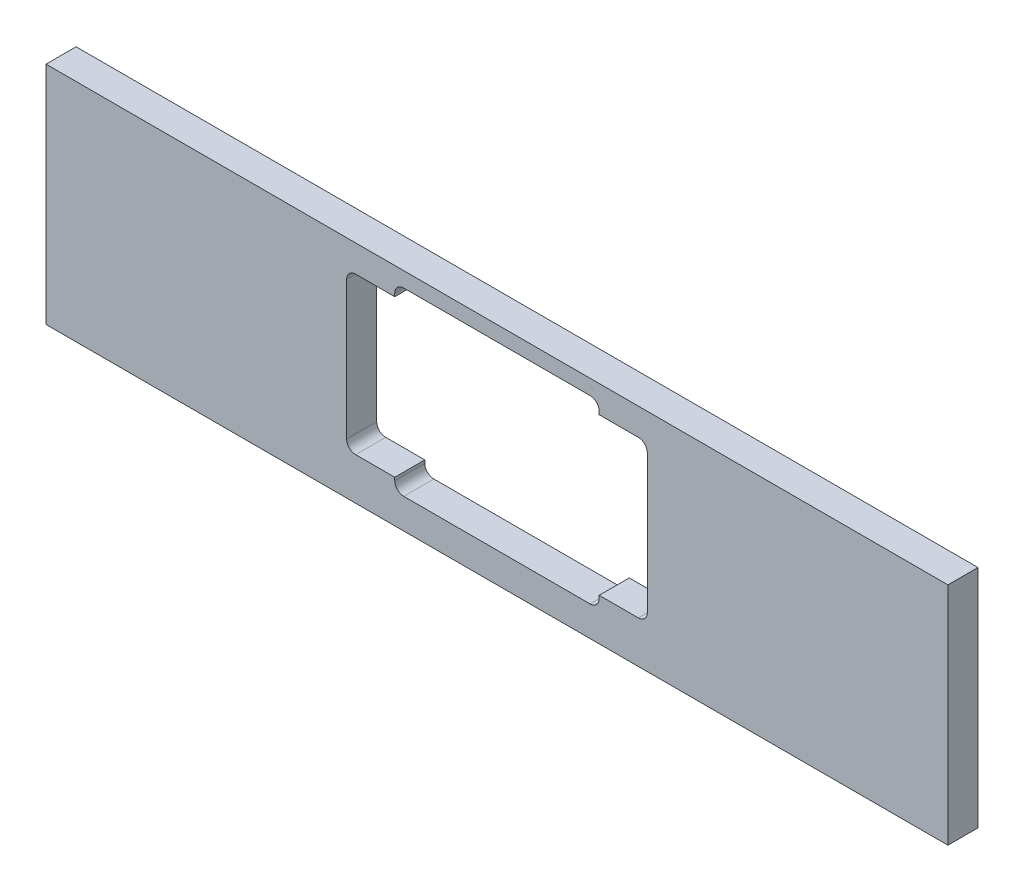
ISO-10303-21;
HEADER;
FILE_DESCRIPTION(('STEP AP214'),'2;1');
FILE_NAME('part.step','',(''),(''),'','','');
FILE_SCHEMA(('AUTOMOTIVE_DESIGN { 1 0 10303 214 1 1 1 1 }'));
ENDSEC;
DATA;
#1=APPLICATION_CONTEXT('core data for automotive mechanical design processes');
#2=APPLICATION_PROTOCOL_DEFINITION('international standard','automotive_design',2000,#1);
#3=PRODUCT_CONTEXT('',#1,'mechanical');
#4=PRODUCT('Part','Part','',(#3));
#5=PRODUCT_RELATED_PRODUCT_CATEGORY('part','',(#4));
#6=PRODUCT_DEFINITION_FORMATION('','',#4);
#7=PRODUCT_DEFINITION_CONTEXT('part definition',#1,'design');
#8=PRODUCT_DEFINITION('design','',#6,#7);
#9=PRODUCT_DEFINITION_SHAPE('','',#8);
#10=(LENGTH_UNIT() NAMED_UNIT(*) SI_UNIT(.MILLI.,.METRE.));
#11=(NAMED_UNIT(*) PLANE_ANGLE_UNIT() SI_UNIT($,.RADIAN.));
#12=(NAMED_UNIT(*) SI_UNIT($,.STERADIAN.) SOLID_ANGLE_UNIT());
#13=UNCERTAINTY_MEASURE_WITH_UNIT(LENGTH_MEASURE(1.E-05),#10,'distance_accuracy_value','');
#14=(GEOMETRIC_REPRESENTATION_CONTEXT(3) GLOBAL_UNCERTAINTY_ASSIGNED_CONTEXT((#13)) GLOBAL_UNIT_ASSIGNED_CONTEXT((#10,
#11,#12)) REPRESENTATION_CONTEXT('',''));
#15=CARTESIAN_POINT('',(0.,0.,0.));
#16=DIRECTION('',(0.,0.,1.));
#17=DIRECTION('',(1.,0.,0.));
#18=AXIS2_PLACEMENT_3D('',#15,#16,#17);
#19=CARTESIAN_POINT('',(150.,-150.,10.));
#20=DIRECTION('',(-1.,0.,0.));
#21=DIRECTION('',(0.,0.,1.));
#22=AXIS2_PLACEMENT_3D('',#19,#20,#21);
#23=PLANE('',#22);
#24=DIRECTION('',(0.,1.,0.));
#25=VECTOR('',#24,1.);
#26=CARTESIAN_POINT('',(150.,-150.,0.));
#27=LINE('',#26,#25);
#28=CARTESIAN_POINT('',(150.,-150.,0.));
#29=VERTEX_POINT('',#28);
#30=CARTESIAN_POINT('',(150.,-75.,0.));
#31=VERTEX_POINT('',#30);
#32=EDGE_CURVE('E275',#29,#31,#27,.T.);
#33=ORIENTED_EDGE('',*,*,#32,.T.);
#34=DIRECTION('',(0.,0.,-1.));
#35=VECTOR('',#34,1.);
#36=CARTESIAN_POINT('',(150.,-75.,10.));
#37=LINE('',#36,#35);
#38=CARTESIAN_POINT('',(150.,-75.,10.));
#39=VERTEX_POINT('',#38);
#40=EDGE_CURVE('E307',#39,#31,#37,.T.);
#41=ORIENTED_EDGE('',*,*,#40,.F.);
#42=DIRECTION('',(0.,1.,0.));
#43=VECTOR('',#42,1.);
#44=CARTESIAN_POINT('',(150.,-150.,10.));
#45=LINE('',#44,#43);
#46=CARTESIAN_POINT('',(150.,-150.,10.));
#47=VERTEX_POINT('',#46);
#48=EDGE_CURVE('E281',#47,#39,#45,.T.);
#49=ORIENTED_EDGE('',*,*,#48,.F.);
#50=DIRECTION('',(0.,0.,-1.));
#51=VECTOR('',#50,1.);
#52=CARTESIAN_POINT('',(150.,-150.,10.));
#53=LINE('',#52,#51);
#54=EDGE_CURVE('E291',#47,#29,#53,.T.);
#55=ORIENTED_EDGE('',*,*,#54,.T.);
#56=EDGE_LOOP('',(#33,#41,#49,#55));
#57=FACE_BOUND('',#56,.T.);
#58=ADVANCED_FACE('F31',(#57),#23,.F.);
#59=CARTESIAN_POINT('',(150.,-75.,10.));
#60=DIRECTION('',(0.,-1.,0.));
#61=DIRECTION('',(1.,0.,0.));
#62=AXIS2_PLACEMENT_3D('',#59,#60,#61);
#63=PLANE('',#62);
#64=DIRECTION('',(-1.,0.,0.));
#65=VECTOR('',#64,1.);
#66=CARTESIAN_POINT('',(150.,-75.,0.));
#67=LINE('',#66,#65);
#68=CARTESIAN_POINT('',(-150.,-75.,0.));
#69=VERTEX_POINT('',#68);
#70=EDGE_CURVE('E294',#31,#69,#67,.T.);
#71=ORIENTED_EDGE('',*,*,#70,.T.);
#72=DIRECTION('',(0.,0.,-1.));
#73=VECTOR('',#72,1.);
#74=CARTESIAN_POINT('',(-150.,-75.,10.));
#75=LINE('',#74,#73);
#76=CARTESIAN_POINT('',(-150.,-75.,10.));
#77=VERTEX_POINT('',#76);
#78=EDGE_CURVE('E304',#77,#69,#75,.T.);
#79=ORIENTED_EDGE('',*,*,#78,.F.);
#80=DIRECTION('',(-1.,0.,0.));
#81=VECTOR('',#80,1.);
#82=CARTESIAN_POINT('',(150.,-75.,10.));
#83=LINE('',#82,#81);
#84=EDGE_CURVE('E284',#39,#77,#83,.T.);
#85=ORIENTED_EDGE('',*,*,#84,.F.);
#86=ORIENTED_EDGE('',*,*,#40,.T.);
#87=EDGE_LOOP('',(#71,#79,#85,#86));
#88=FACE_BOUND('',#87,.T.);
#89=ADVANCED_FACE('F438',(#88),#63,.F.);
#90=CARTESIAN_POINT('',(-150.,-150.,10.));
#91=DIRECTION('',(1.,0.,0.));
#92=DIRECTION('',(0.,0.,-1.));
#93=AXIS2_PLACEMENT_3D('',#90,#91,#92);
#94=PLANE('',#93);
#95=DIRECTION('',(0.,-1.,0.));
#96=VECTOR('',#95,1.);
#97=CARTESIAN_POINT('',(-150.,-150.,0.));
#98=LINE('',#97,#96);
#99=CARTESIAN_POINT('',(-150.,-150.,0.));
#100=VERTEX_POINT('',#99);
#101=EDGE_CURVE('E296',#69,#100,#98,.T.);
#102=ORIENTED_EDGE('',*,*,#101,.T.);
#103=DIRECTION('',(0.,0.,-1.));
#104=VECTOR('',#103,1.);
#105=CARTESIAN_POINT('',(-150.,-150.,10.));
#106=LINE('',#105,#104);
#107=CARTESIAN_POINT('',(-150.,-150.,10.));
#108=VERTEX_POINT('',#107);
#109=EDGE_CURVE('E301',#108,#100,#106,.T.);
#110=ORIENTED_EDGE('',*,*,#109,.F.);
#111=DIRECTION('',(0.,-1.,0.));
#112=VECTOR('',#111,1.);
#113=CARTESIAN_POINT('',(-150.,-150.,10.));
#114=LINE('',#113,#112);
#115=EDGE_CURVE('E287',#77,#108,#114,.T.);
#116=ORIENTED_EDGE('',*,*,#115,.F.);
#117=ORIENTED_EDGE('',*,*,#78,.T.);
#118=EDGE_LOOP('',(#102,#110,#116,#117));
#119=FACE_BOUND('',#118,.T.);
#120=ADVANCED_FACE('F444',(#119),#94,.F.);
#121=CARTESIAN_POINT('',(150.,-150.,10.));
#122=DIRECTION('',(0.,1.,0.));
#123=DIRECTION('',(-1.,0.,0.));
#124=AXIS2_PLACEMENT_3D('',#121,#122,#123);
#125=PLANE('',#124);
#126=DIRECTION('',(1.,0.,0.));
#127=VECTOR('',#126,1.);
#128=CARTESIAN_POINT('',(150.,-150.,0.));
#129=LINE('',#128,#127);
#130=EDGE_CURVE('E285',#100,#29,#129,.T.);
#131=ORIENTED_EDGE('',*,*,#130,.T.);
#132=ORIENTED_EDGE('',*,*,#54,.F.);
#133=DIRECTION('',(1.,0.,0.));
#134=VECTOR('',#133,1.);
#135=CARTESIAN_POINT('',(150.,-150.,10.));
#136=LINE('',#135,#134);
#137=EDGE_CURVE('E289',#108,#47,#136,.T.);
#138=ORIENTED_EDGE('',*,*,#137,.F.);
#139=ORIENTED_EDGE('',*,*,#109,.T.);
#140=EDGE_LOOP('',(#131,#132,#138,#139));
#141=FACE_BOUND('',#140,.T.);
#142=ADVANCED_FACE('F535',(#141),#125,.F.);
#143=CARTESIAN_POINT('',(150.,-75.,10.));
#144=DIRECTION('',(0.,0.,1.));
#145=DIRECTION('',(1.,0.,0.));
#146=AXIS2_PLACEMENT_3D('',#143,#144,#145);
#147=PLANE('',#146);
#148=DIRECTION('',(0.,-1.,0.));
#149=VECTOR('',#148,1.);
#150=CARTESIAN_POINT('',(-34.,-140.,10.));
#151=LINE('',#150,#149);
#152=CARTESIAN_POINT('',(-34.,-136.,10.));
#153=VERTEX_POINT('',#152);
#154=CARTESIAN_POINT('',(-34.,-137.,10.));
#155=VERTEX_POINT('',#154);
#156=EDGE_CURVE('E241',#153,#155,#151,.T.);
#157=ORIENTED_EDGE('',*,*,#156,.F.);
#158=DIRECTION('',(1.,0.,0.));
#159=VECTOR('',#158,1.);
#160=CARTESIAN_POINT('',(-50.,-136.,10.));
#161=LINE('',#160,#159);
#162=CARTESIAN_POINT('',(-46.9999999999999,-136.,10.));
#163=VERTEX_POINT('',#162);
#164=EDGE_CURVE('E269',#163,#153,#161,.T.);
#165=ORIENTED_EDGE('',*,*,#164,.F.);
#166=CARTESIAN_POINT('',(-46.9999999999999,-133.,10.));
#167=DIRECTION('',(0.,0.,1.));
#168=DIRECTION('',(1.,0.,0.));
#169=AXIS2_PLACEMENT_3D('',#166,#167,#168);
#170=CIRCLE('',#169,3.);
#171=CARTESIAN_POINT('',(-50.,-133.,10.));
#172=VERTEX_POINT('',#171);
#173=EDGE_CURVE('E347',#163,#172,#170,.F.);
#174=ORIENTED_EDGE('',*,*,#173,.T.);
#175=DIRECTION('',(0.,-1.,0.));
#176=VECTOR('',#175,1.);
#177=CARTESIAN_POINT('',(-50.,-136.,10.));
#178=LINE('',#177,#176);
#179=CARTESIAN_POINT('',(-50.,-87.,10.));
#180=VERTEX_POINT('',#179);
#181=EDGE_CURVE('E266',#180,#172,#178,.T.);
#182=ORIENTED_EDGE('',*,*,#181,.F.);
#183=CARTESIAN_POINT('',(-46.9999999999999,-87.,10.));
#184=DIRECTION('',(0.,0.,1.));
#185=DIRECTION('',(1.,0.,0.));
#186=AXIS2_PLACEMENT_3D('',#183,#184,#185);
#187=CIRCLE('',#186,3.);
#188=CARTESIAN_POINT('',(-46.9999999999999,-84.,10.));
#189=VERTEX_POINT('',#188);
#190=EDGE_CURVE('E370',#180,#189,#187,.F.);
#191=ORIENTED_EDGE('',*,*,#190,.T.);
#192=DIRECTION('',(-1.,0.,0.));
#193=VECTOR('',#192,1.);
#194=CARTESIAN_POINT('',(-50.,-84.,10.));
#195=LINE('',#194,#193);
#196=CARTESIAN_POINT('',(-34.,-84.,10.));
#197=VERTEX_POINT('',#196);
#198=EDGE_CURVE('E263',#197,#189,#195,.T.);
#199=ORIENTED_EDGE('',*,*,#198,.F.);
#200=DIRECTION('',(0.,-1.,0.));
#201=VECTOR('',#200,1.);
#202=CARTESIAN_POINT('',(-34.,-84.,10.));
#203=LINE('',#202,#201);
#204=CARTESIAN_POINT('',(-34.,-83.,10.));
#205=VERTEX_POINT('',#204);
#206=EDGE_CURVE('E261',#205,#197,#203,.T.);
#207=ORIENTED_EDGE('',*,*,#206,.F.);
#208=CARTESIAN_POINT('',(-31.,-83.,10.));
#209=DIRECTION('',(0.,0.,1.));
#210=DIRECTION('',(1.,0.,0.));
#211=AXIS2_PLACEMENT_3D('',#208,#209,#210);
#212=CIRCLE('',#211,3.);
#213=CARTESIAN_POINT('',(-31.,-80.,10.));
#214=VERTEX_POINT('',#213);
#215=EDGE_CURVE('E39',#205,#214,#212,.F.);
#216=ORIENTED_EDGE('',*,*,#215,.T.);
#217=DIRECTION('',(-1.,0.,0.));
#218=VECTOR('',#217,1.);
#219=CARTESIAN_POINT('',(-34.,-80.,10.));
#220=LINE('',#219,#218);
#221=CARTESIAN_POINT('',(31.,-80.,10.));
#222=VERTEX_POINT('',#221);
#223=EDGE_CURVE('E258',#222,#214,#220,.T.);
#224=ORIENTED_EDGE('',*,*,#223,.F.);
#225=CARTESIAN_POINT('',(31.,-83.,10.));
#226=DIRECTION('',(0.,0.,1.));
#227=DIRECTION('',(1.,0.,0.));
#228=AXIS2_PLACEMENT_3D('',#225,#226,#227);
#229=CIRCLE('',#228,3.);
#230=CARTESIAN_POINT('',(34.,-83.,10.));
#231=VERTEX_POINT('',#230);
#232=EDGE_CURVE('E366',#222,#231,#229,.F.);
#233=ORIENTED_EDGE('',*,*,#232,.T.);
#234=DIRECTION('',(0.,1.,0.));
#235=VECTOR('',#234,1.);
#236=CARTESIAN_POINT('',(34.,-80.,10.));
#237=LINE('',#236,#235);
#238=CARTESIAN_POINT('',(34.,-84.,10.));
#239=VERTEX_POINT('',#238);
#240=EDGE_CURVE('E255',#239,#231,#237,.T.);
#241=ORIENTED_EDGE('',*,*,#240,.F.);
#242=DIRECTION('',(-1.,0.,0.));
#243=VECTOR('',#242,1.);
#244=CARTESIAN_POINT('',(50.,-84.,10.));
#245=LINE('',#244,#243);
#246=CARTESIAN_POINT('',(47.,-84.,10.));
#247=VERTEX_POINT('',#246);
#248=EDGE_CURVE('E253',#247,#239,#245,.T.);
#249=ORIENTED_EDGE('',*,*,#248,.F.);
#250=CARTESIAN_POINT('',(47.,-87.,10.));
#251=DIRECTION('',(0.,0.,1.));
#252=DIRECTION('',(1.,0.,0.));
#253=AXIS2_PLACEMENT_3D('',#250,#251,#252);
#254=CIRCLE('',#253,3.);
#255=CARTESIAN_POINT('',(50.,-87.,10.));
#256=VERTEX_POINT('',#255);
#257=EDGE_CURVE('E362',#247,#256,#254,.F.);
#258=ORIENTED_EDGE('',*,*,#257,.T.);
#259=DIRECTION('',(0.,1.,0.));
#260=VECTOR('',#259,1.);
#261=CARTESIAN_POINT('',(50.,-84.,10.));
#262=LINE('',#261,#260);
#263=CARTESIAN_POINT('',(50.,-133.,10.));
#264=VERTEX_POINT('',#263);
#265=EDGE_CURVE('E250',#264,#256,#262,.T.);
#266=ORIENTED_EDGE('',*,*,#265,.F.);
#267=CARTESIAN_POINT('',(47.,-133.,10.));
#268=DIRECTION('',(0.,0.,1.));
#269=DIRECTION('',(1.,0.,0.));
#270=AXIS2_PLACEMENT_3D('',#267,#268,#269);
#271=CIRCLE('',#270,3.);
#272=CARTESIAN_POINT('',(47.,-136.,10.));
#273=VERTEX_POINT('',#272);
#274=EDGE_CURVE('E355',#264,#273,#271,.F.);
#275=ORIENTED_EDGE('',*,*,#274,.T.);
#276=DIRECTION('',(1.,0.,0.));
#277=VECTOR('',#276,1.);
#278=CARTESIAN_POINT('',(50.,-136.,10.));
#279=LINE('',#278,#277);
#280=CARTESIAN_POINT('',(34.,-136.,10.));
#281=VERTEX_POINT('',#280);
#282=EDGE_CURVE('E248',#281,#273,#279,.T.);
#283=ORIENTED_EDGE('',*,*,#282,.F.);
#284=DIRECTION('',(0.,1.,0.));
#285=VECTOR('',#284,1.);
#286=CARTESIAN_POINT('',(34.,-140.,10.));
#287=LINE('',#286,#285);
#288=CARTESIAN_POINT('',(34.,-137.,10.));
#289=VERTEX_POINT('',#288);
#290=EDGE_CURVE('E210',#289,#281,#287,.T.);
#291=ORIENTED_EDGE('',*,*,#290,.F.);
#292=CARTESIAN_POINT('',(31.,-137.,10.));
#293=DIRECTION('',(0.,0.,1.));
#294=DIRECTION('',(1.,0.,0.));
#295=AXIS2_PLACEMENT_3D('',#292,#293,#294);
#296=CIRCLE('',#295,3.);
#297=CARTESIAN_POINT('',(31.,-140.,10.));
#298=VERTEX_POINT('',#297);
#299=EDGE_CURVE('E359',#289,#298,#296,.F.);
#300=ORIENTED_EDGE('',*,*,#299,.T.);
#301=DIRECTION('',(1.,0.,0.));
#302=VECTOR('',#301,1.);
#303=CARTESIAN_POINT('',(-34.,-140.,10.));
#304=LINE('',#303,#302);
#305=CARTESIAN_POINT('',(-31.,-140.,10.));
#306=VERTEX_POINT('',#305);
#307=EDGE_CURVE('E244',#306,#298,#304,.T.);
#308=ORIENTED_EDGE('',*,*,#307,.F.);
#309=CARTESIAN_POINT('',(-31.,-137.,10.));
#310=DIRECTION('',(0.,0.,1.));
#311=DIRECTION('',(1.,0.,0.));
#312=AXIS2_PLACEMENT_3D('',#309,#310,#311);
#313=CIRCLE('',#312,3.);
#314=EDGE_CURVE('E351',#306,#155,#313,.F.);
#315=ORIENTED_EDGE('',*,*,#314,.T.);
#316=EDGE_LOOP('',(#157,#165,#174,#182,#191,#199,#207,#216,#224,#233,#241,#249,#258,#266,#275,
#283,#291,#300,#308,#315));
#317=FACE_BOUND('',#316,.T.);
#318=ORIENTED_EDGE('',*,*,#48,.T.);
#319=ORIENTED_EDGE('',*,*,#84,.T.);
#320=ORIENTED_EDGE('',*,*,#115,.T.);
#321=ORIENTED_EDGE('',*,*,#137,.T.);
#322=EDGE_LOOP('',(#318,#319,#320,#321));
#323=FACE_BOUND('',#322,.T.);
#324=ADVANCED_FACE('F377',(#317,#323),#147,.T.);
#325=CARTESIAN_POINT('',(150.,-75.,0.));
#326=DIRECTION('',(0.,0.,1.));
#327=DIRECTION('',(1.,0.,0.));
#328=AXIS2_PLACEMENT_3D('',#325,#326,#327);
#329=PLANE('',#328);
#330=DIRECTION('',(0.,-1.,0.));
#331=VECTOR('',#330,1.);
#332=CARTESIAN_POINT('',(-50.,-136.,0.));
#333=LINE('',#332,#331);
#334=CARTESIAN_POINT('',(-50.,-87.,0.));
#335=VERTEX_POINT('',#334);
#336=CARTESIAN_POINT('',(-50.,-133.,0.));
#337=VERTEX_POINT('',#336);
#338=EDGE_CURVE('E238',#335,#337,#333,.T.);
#339=ORIENTED_EDGE('',*,*,#338,.T.);
#340=CARTESIAN_POINT('',(-46.9999999999999,-133.,0.));
#341=DIRECTION('',(0.,0.,1.));
#342=DIRECTION('',(1.,0.,0.));
#343=AXIS2_PLACEMENT_3D('',#340,#341,#342);
#344=CIRCLE('',#343,3.);
#345=CARTESIAN_POINT('',(-46.9999999999999,-136.,0.));
#346=VERTEX_POINT('',#345);
#347=EDGE_CURVE('E349',#337,#346,#344,.T.);
#348=ORIENTED_EDGE('',*,*,#347,.T.);
#349=DIRECTION('',(1.,0.,0.));
#350=VECTOR('',#349,1.);
#351=CARTESIAN_POINT('',(-50.,-136.,0.));
#352=LINE('',#351,#350);
#353=CARTESIAN_POINT('',(-34.,-136.,0.));
#354=VERTEX_POINT('',#353);
#355=EDGE_CURVE('E215',#346,#354,#352,.T.);
#356=ORIENTED_EDGE('',*,*,#355,.T.);
#357=DIRECTION('',(0.,-1.,0.));
#358=VECTOR('',#357,1.);
#359=CARTESIAN_POINT('',(-34.,-140.,0.));
#360=LINE('',#359,#358);
#361=CARTESIAN_POINT('',(-34.,-137.,0.));
#362=VERTEX_POINT('',#361);
#363=EDGE_CURVE('E271',#354,#362,#360,.T.);
#364=ORIENTED_EDGE('',*,*,#363,.T.);
#365=CARTESIAN_POINT('',(-31.,-137.,0.));
#366=DIRECTION('',(0.,0.,1.));
#367=DIRECTION('',(1.,0.,0.));
#368=AXIS2_PLACEMENT_3D('',#365,#366,#367);
#369=CIRCLE('',#368,3.);
#370=CARTESIAN_POINT('',(-31.,-140.,0.));
#371=VERTEX_POINT('',#370);
#372=EDGE_CURVE('E353',#362,#371,#369,.T.);
#373=ORIENTED_EDGE('',*,*,#372,.T.);
#374=DIRECTION('',(1.,0.,0.));
#375=VECTOR('',#374,1.);
#376=CARTESIAN_POINT('',(-34.,-140.,0.));
#377=LINE('',#376,#375);
#378=CARTESIAN_POINT('',(31.,-140.,0.));
#379=VERTEX_POINT('',#378);
#380=EDGE_CURVE('E204',#371,#379,#377,.T.);
#381=ORIENTED_EDGE('',*,*,#380,.T.);
#382=CARTESIAN_POINT('',(31.,-137.,0.));
#383=DIRECTION('',(0.,0.,1.));
#384=DIRECTION('',(1.,0.,0.));
#385=AXIS2_PLACEMENT_3D('',#382,#383,#384);
#386=CIRCLE('',#385,3.);
#387=CARTESIAN_POINT('',(34.,-137.,0.));
#388=VERTEX_POINT('',#387);
#389=EDGE_CURVE('E200',#379,#388,#386,.T.);
#390=ORIENTED_EDGE('',*,*,#389,.T.);
#391=DIRECTION('',(0.,1.,0.));
#392=VECTOR('',#391,1.);
#393=CARTESIAN_POINT('',(34.,-140.,0.));
#394=LINE('',#393,#392);
#395=CARTESIAN_POINT('',(34.,-136.,0.));
#396=VERTEX_POINT('',#395);
#397=EDGE_CURVE('E190',#388,#396,#394,.T.);
#398=ORIENTED_EDGE('',*,*,#397,.T.);
#399=DIRECTION('',(1.,0.,0.));
#400=VECTOR('',#399,1.);
#401=CARTESIAN_POINT('',(50.,-136.,0.));
#402=LINE('',#401,#400);
#403=CARTESIAN_POINT('',(47.,-136.,0.));
#404=VERTEX_POINT('',#403);
#405=EDGE_CURVE('E196',#396,#404,#402,.T.);
#406=ORIENTED_EDGE('',*,*,#405,.T.);
#407=CARTESIAN_POINT('',(47.,-133.,0.));
#408=DIRECTION('',(0.,0.,1.));
#409=DIRECTION('',(1.,0.,0.));
#410=AXIS2_PLACEMENT_3D('',#407,#408,#409);
#411=CIRCLE('',#410,3.);
#412=CARTESIAN_POINT('',(50.,-133.,0.));
#413=VERTEX_POINT('',#412);
#414=EDGE_CURVE('E357',#404,#413,#411,.T.);
#415=ORIENTED_EDGE('',*,*,#414,.T.);
#416=DIRECTION('',(0.,1.,0.));
#417=VECTOR('',#416,1.);
#418=CARTESIAN_POINT('',(50.,-84.,0.));
#419=LINE('',#418,#417);
#420=CARTESIAN_POINT('',(50.,-87.,0.));
#421=VERTEX_POINT('',#420);
#422=EDGE_CURVE('E220',#413,#421,#419,.T.);
#423=ORIENTED_EDGE('',*,*,#422,.T.);
#424=CARTESIAN_POINT('',(47.,-87.,0.));
#425=DIRECTION('',(0.,0.,1.));
#426=DIRECTION('',(1.,0.,0.));
#427=AXIS2_PLACEMENT_3D('',#424,#425,#426);
#428=CIRCLE('',#427,3.);
#429=CARTESIAN_POINT('',(47.,-84.,0.));
#430=VERTEX_POINT('',#429);
#431=EDGE_CURVE('E364',#421,#430,#428,.T.);
#432=ORIENTED_EDGE('',*,*,#431,.T.);
#433=DIRECTION('',(-1.,0.,0.));
#434=VECTOR('',#433,1.);
#435=CARTESIAN_POINT('',(50.,-84.,0.));
#436=LINE('',#435,#434);
#437=CARTESIAN_POINT('',(34.,-84.,0.));
#438=VERTEX_POINT('',#437);
#439=EDGE_CURVE('E223',#430,#438,#436,.T.);
#440=ORIENTED_EDGE('',*,*,#439,.T.);
#441=DIRECTION('',(0.,1.,0.));
#442=VECTOR('',#441,1.);
#443=CARTESIAN_POINT('',(34.,-80.,0.));
#444=LINE('',#443,#442);
#445=CARTESIAN_POINT('',(34.,-83.,0.));
#446=VERTEX_POINT('',#445);
#447=EDGE_CURVE('E228',#438,#446,#444,.T.);
#448=ORIENTED_EDGE('',*,*,#447,.T.);
#449=CARTESIAN_POINT('',(31.,-83.,0.));
#450=DIRECTION('',(0.,0.,1.));
#451=DIRECTION('',(1.,0.,0.));
#452=AXIS2_PLACEMENT_3D('',#449,#450,#451);
#453=CIRCLE('',#452,3.);
#454=CARTESIAN_POINT('',(31.,-80.,0.));
#455=VERTEX_POINT('',#454);
#456=EDGE_CURVE('E368',#446,#455,#453,.T.);
#457=ORIENTED_EDGE('',*,*,#456,.T.);
#458=DIRECTION('',(-1.,0.,0.));
#459=VECTOR('',#458,1.);
#460=CARTESIAN_POINT('',(-34.,-80.,0.));
#461=LINE('',#460,#459);
#462=CARTESIAN_POINT('',(-31.,-80.,0.));
#463=VERTEX_POINT('',#462);
#464=EDGE_CURVE('E231',#455,#463,#461,.T.);
#465=ORIENTED_EDGE('',*,*,#464,.T.);
#466=CARTESIAN_POINT('',(-31.,-83.,0.));
#467=DIRECTION('',(0.,0.,1.));
#468=DIRECTION('',(1.,0.,0.));
#469=AXIS2_PLACEMENT_3D('',#466,#467,#468);
#470=CIRCLE('',#469,3.);
#471=CARTESIAN_POINT('',(-34.,-83.,0.));
#472=VERTEX_POINT('',#471);
#473=EDGE_CURVE('E11',#463,#472,#470,.T.);
#474=ORIENTED_EDGE('',*,*,#473,.T.);
#475=DIRECTION('',(0.,-1.,0.));
#476=VECTOR('',#475,1.);
#477=CARTESIAN_POINT('',(-34.,-84.,0.));
#478=LINE('',#477,#476);
#479=CARTESIAN_POINT('',(-34.,-84.,0.));
#480=VERTEX_POINT('',#479);
#481=EDGE_CURVE('E233',#472,#480,#478,.T.);
#482=ORIENTED_EDGE('',*,*,#481,.T.);
#483=DIRECTION('',(-1.,0.,0.));
#484=VECTOR('',#483,1.);
#485=CARTESIAN_POINT('',(-50.,-84.,0.));
#486=LINE('',#485,#484);
#487=CARTESIAN_POINT('',(-46.9999999999999,-84.,0.));
#488=VERTEX_POINT('',#487);
#489=EDGE_CURVE('E235',#480,#488,#486,.T.);
#490=ORIENTED_EDGE('',*,*,#489,.T.);
#491=CARTESIAN_POINT('',(-46.9999999999999,-87.,0.));
#492=DIRECTION('',(0.,0.,1.));
#493=DIRECTION('',(1.,0.,0.));
#494=AXIS2_PLACEMENT_3D('',#491,#492,#493);
#495=CIRCLE('',#494,3.);
#496=EDGE_CURVE('E372',#488,#335,#495,.T.);
#497=ORIENTED_EDGE('',*,*,#496,.T.);
#498=EDGE_LOOP('',(#339,#348,#356,#364,#373,#381,#390,#398,#406,#415,#423,#432,#440,#448,#457,
#465,#474,#482,#490,#497));
#499=FACE_BOUND('',#498,.T.);
#500=ORIENTED_EDGE('',*,*,#32,.F.);
#501=ORIENTED_EDGE('',*,*,#130,.F.);
#502=ORIENTED_EDGE('',*,*,#101,.F.);
#503=ORIENTED_EDGE('',*,*,#70,.F.);
#504=EDGE_LOOP('',(#500,#501,#502,#503));
#505=FACE_BOUND('',#504,.T.);
#506=ADVANCED_FACE('F193',(#499,#505),#329,.F.);
#507=CARTESIAN_POINT('',(-34.,-140.,0.));
#508=DIRECTION('',(-1.,0.,0.));
#509=DIRECTION('',(0.,0.,1.));
#510=AXIS2_PLACEMENT_3D('',#507,#508,#509);
#511=PLANE('',#510);
#512=ORIENTED_EDGE('',*,*,#156,.T.);
#513=DIRECTION('',(0.,0.,1.));
#514=VECTOR('',#513,1.);
#515=CARTESIAN_POINT('',(-34.,-137.,0.));
#516=LINE('',#515,#514);
#517=EDGE_CURVE('E323',#155,#362,#516,.F.);
#518=ORIENTED_EDGE('',*,*,#517,.T.);
#519=ORIENTED_EDGE('',*,*,#363,.F.);
#520=DIRECTION('',(0.,0.,1.));
#521=VECTOR('',#520,1.);
#522=CARTESIAN_POINT('',(-34.,-136.,0.));
#523=LINE('',#522,#521);
#524=EDGE_CURVE('E272',#354,#153,#523,.T.);
#525=ORIENTED_EDGE('',*,*,#524,.T.);
#526=EDGE_LOOP('',(#512,#518,#519,#525));
#527=FACE_BOUND('',#526,.T.);
#528=ADVANCED_FACE('F530',(#527),#511,.F.);
#529=CARTESIAN_POINT('',(-50.,-136.,0.));
#530=DIRECTION('',(0.,-1.,0.));
#531=DIRECTION('',(0.,0.,-1.));
#532=AXIS2_PLACEMENT_3D('',#529,#530,#531);
#533=PLANE('',#532);
#534=ORIENTED_EDGE('',*,*,#355,.F.);
#535=DIRECTION('',(0.,0.,1.));
#536=VECTOR('',#535,1.);
#537=CARTESIAN_POINT('',(-46.9999999999999,-136.,10.));
#538=LINE('',#537,#536);
#539=EDGE_CURVE('E310',#346,#163,#538,.T.);
#540=ORIENTED_EDGE('',*,*,#539,.T.);
#541=ORIENTED_EDGE('',*,*,#164,.T.);
#542=ORIENTED_EDGE('',*,*,#524,.F.);
#543=EDGE_LOOP('',(#534,#540,#541,#542));
#544=FACE_BOUND('',#543,.T.);
#545=ADVANCED_FACE('F406',(#544),#533,.F.);
#546=CARTESIAN_POINT('',(-50.,-136.,0.));
#547=DIRECTION('',(-1.,0.,0.));
#548=DIRECTION('',(0.,0.,1.));
#549=AXIS2_PLACEMENT_3D('',#546,#547,#548);
#550=PLANE('',#549);
#551=ORIENTED_EDGE('',*,*,#181,.T.);
#552=DIRECTION('',(0.,0.,1.));
#553=VECTOR('',#552,1.);
#554=CARTESIAN_POINT('',(-50.,-133.,0.));
#555=LINE('',#554,#553);
#556=EDGE_CURVE('E316',#172,#337,#555,.F.);
#557=ORIENTED_EDGE('',*,*,#556,.T.);
#558=ORIENTED_EDGE('',*,*,#338,.F.);
#559=DIRECTION('',(0.,0.,1.));
#560=VECTOR('',#559,1.);
#561=CARTESIAN_POINT('',(-50.,-87.,10.));
#562=LINE('',#561,#560);
#563=EDGE_CURVE('E313',#335,#180,#562,.T.);
#564=ORIENTED_EDGE('',*,*,#563,.T.);
#565=EDGE_LOOP('',(#551,#557,#558,#564));
#566=FACE_BOUND('',#565,.T.);
#567=ADVANCED_FACE('F397',(#566),#550,.F.);
#568=CARTESIAN_POINT('',(-50.,-84.,0.));
#569=DIRECTION('',(0.,1.,0.));
#570=DIRECTION('',(0.,0.,1.));
#571=AXIS2_PLACEMENT_3D('',#568,#569,#570);
#572=PLANE('',#571);
#573=ORIENTED_EDGE('',*,*,#198,.T.);
#574=DIRECTION('',(0.,0.,1.));
#575=VECTOR('',#574,1.);
#576=CARTESIAN_POINT('',(-46.9999999999999,-84.,0.));
#577=LINE('',#576,#575);
#578=EDGE_CURVE('E343',#189,#488,#577,.F.);
#579=ORIENTED_EDGE('',*,*,#578,.T.);
#580=ORIENTED_EDGE('',*,*,#489,.F.);
#581=DIRECTION('',(0.,0.,1.));
#582=VECTOR('',#581,1.);
#583=CARTESIAN_POINT('',(-34.,-84.,0.));
#584=LINE('',#583,#582);
#585=EDGE_CURVE('E276',#480,#197,#584,.T.);
#586=ORIENTED_EDGE('',*,*,#585,.T.);
#587=EDGE_LOOP('',(#573,#579,#580,#586));
#588=FACE_BOUND('',#587,.T.);
#589=ADVANCED_FACE('F588',(#588),#572,.F.);
#590=CARTESIAN_POINT('',(-34.,-84.,0.));
#591=DIRECTION('',(-1.,0.,0.));
#592=DIRECTION('',(0.,0.,1.));
#593=AXIS2_PLACEMENT_3D('',#590,#591,#592);
#594=PLANE('',#593);
#595=ORIENTED_EDGE('',*,*,#481,.F.);
#596=DIRECTION('',(0.,0.,1.));
#597=VECTOR('',#596,1.);
#598=CARTESIAN_POINT('',(-34.,-83.,10.));
#599=LINE('',#598,#597);
#600=EDGE_CURVE('E345',#472,#205,#599,.T.);
#601=ORIENTED_EDGE('',*,*,#600,.T.);
#602=ORIENTED_EDGE('',*,*,#206,.T.);
#603=ORIENTED_EDGE('',*,*,#585,.F.);
#604=EDGE_LOOP('',(#595,#601,#602,#603));
#605=FACE_BOUND('',#604,.T.);
#606=ADVANCED_FACE('F385',(#605),#594,.F.);
#607=CARTESIAN_POINT('',(-34.,-80.,0.));
#608=DIRECTION('',(0.,1.,0.));
#609=DIRECTION('',(0.,0.,1.));
#610=AXIS2_PLACEMENT_3D('',#607,#608,#609);
#611=PLANE('',#610);
#612=ORIENTED_EDGE('',*,*,#464,.F.);
#613=DIRECTION('',(0.,0.,1.));
#614=VECTOR('',#613,1.);
#615=CARTESIAN_POINT('',(31.,-80.,10.));
#616=LINE('',#615,#614);
#617=EDGE_CURVE('E338',#455,#222,#616,.T.);
#618=ORIENTED_EDGE('',*,*,#617,.T.);
#619=ORIENTED_EDGE('',*,*,#223,.T.);
#620=DIRECTION('',(0.,0.,1.));
#621=VECTOR('',#620,1.);
#622=CARTESIAN_POINT('',(-31.,-80.,0.));
#623=LINE('',#622,#621);
#624=EDGE_CURVE('E336',#214,#463,#623,.F.);
#625=ORIENTED_EDGE('',*,*,#624,.T.);
#626=EDGE_LOOP('',(#612,#618,#619,#625));
#627=FACE_BOUND('',#626,.T.);
#628=ADVANCED_FACE('F382',(#627),#611,.F.);
#629=CARTESIAN_POINT('',(34.,-80.,0.));
#630=DIRECTION('',(1.,0.,0.));
#631=DIRECTION('',(0.,0.,-1.));
#632=AXIS2_PLACEMENT_3D('',#629,#630,#631);
#633=PLANE('',#632);
#634=ORIENTED_EDGE('',*,*,#240,.T.);
#635=DIRECTION('',(0.,0.,1.));
#636=VECTOR('',#635,1.);
#637=CARTESIAN_POINT('',(34.,-83.,0.));
#638=LINE('',#637,#636);
#639=EDGE_CURVE('E341',#231,#446,#638,.F.);
#640=ORIENTED_EDGE('',*,*,#639,.T.);
#641=ORIENTED_EDGE('',*,*,#447,.F.);
#642=DIRECTION('',(0.,0.,1.));
#643=VECTOR('',#642,1.);
#644=CARTESIAN_POINT('',(34.,-84.,0.));
#645=LINE('',#644,#643);
#646=EDGE_CURVE('E214',#438,#239,#645,.T.);
#647=ORIENTED_EDGE('',*,*,#646,.T.);
#648=EDGE_LOOP('',(#634,#640,#641,#647));
#649=FACE_BOUND('',#648,.T.);
#650=ADVANCED_FACE('F504',(#649),#633,.F.);
#651=CARTESIAN_POINT('',(50.,-84.,0.));
#652=DIRECTION('',(0.,1.,0.));
#653=DIRECTION('',(0.,0.,1.));
#654=AXIS2_PLACEMENT_3D('',#651,#652,#653);
#655=PLANE('',#654);
#656=ORIENTED_EDGE('',*,*,#439,.F.);
#657=DIRECTION('',(0.,0.,1.));
#658=VECTOR('',#657,1.);
#659=CARTESIAN_POINT('',(47.,-84.,10.));
#660=LINE('',#659,#658);
#661=EDGE_CURVE('E333',#430,#247,#660,.T.);
#662=ORIENTED_EDGE('',*,*,#661,.T.);
#663=ORIENTED_EDGE('',*,*,#248,.T.);
#664=ORIENTED_EDGE('',*,*,#646,.F.);
#665=EDGE_LOOP('',(#656,#662,#663,#664));
#666=FACE_BOUND('',#665,.T.);
#667=ADVANCED_FACE('F509',(#666),#655,.F.);
#668=CARTESIAN_POINT('',(50.,-84.,0.));
#669=DIRECTION('',(1.,0.,0.));
#670=DIRECTION('',(0.,0.,-1.));
#671=AXIS2_PLACEMENT_3D('',#668,#669,#670);
#672=PLANE('',#671);
#673=ORIENTED_EDGE('',*,*,#422,.F.);
#674=DIRECTION('',(0.,0.,1.));
#675=VECTOR('',#674,1.);
#676=CARTESIAN_POINT('',(50.,-133.,10.));
#677=LINE('',#676,#675);
#678=EDGE_CURVE('E327',#413,#264,#677,.T.);
#679=ORIENTED_EDGE('',*,*,#678,.T.);
#680=ORIENTED_EDGE('',*,*,#265,.T.);
#681=DIRECTION('',(0.,0.,1.));
#682=VECTOR('',#681,1.);
#683=CARTESIAN_POINT('',(50.,-87.,0.));
#684=LINE('',#683,#682);
#685=EDGE_CURVE('E325',#256,#421,#684,.F.);
#686=ORIENTED_EDGE('',*,*,#685,.T.);
#687=EDGE_LOOP('',(#673,#679,#680,#686));
#688=FACE_BOUND('',#687,.T.);
#689=ADVANCED_FACE('F515',(#688),#672,.F.);
#690=CARTESIAN_POINT('',(50.,-136.,0.));
#691=DIRECTION('',(0.,-1.,0.));
#692=DIRECTION('',(0.,0.,-1.));
#693=AXIS2_PLACEMENT_3D('',#690,#691,#692);
#694=PLANE('',#693);
#695=ORIENTED_EDGE('',*,*,#282,.T.);
#696=DIRECTION('',(0.,0.,1.));
#697=VECTOR('',#696,1.);
#698=CARTESIAN_POINT('',(47.,-136.,0.));
#699=LINE('',#698,#697);
#700=EDGE_CURVE('E219',#273,#404,#699,.F.);
#701=ORIENTED_EDGE('',*,*,#700,.T.);
#702=ORIENTED_EDGE('',*,*,#405,.F.);
#703=DIRECTION('',(0.,0.,1.));
#704=VECTOR('',#703,1.);
#705=CARTESIAN_POINT('',(34.,-136.,0.));
#706=LINE('',#705,#704);
#707=EDGE_CURVE('E207',#396,#281,#706,.T.);
#708=ORIENTED_EDGE('',*,*,#707,.T.);
#709=EDGE_LOOP('',(#695,#701,#702,#708));
#710=FACE_BOUND('',#709,.T.);
#711=ADVANCED_FACE('F217',(#710),#694,.F.);
#712=CARTESIAN_POINT('',(34.,-140.,0.));
#713=DIRECTION('',(1.,0.,0.));
#714=DIRECTION('',(0.,1.,0.));
#715=AXIS2_PLACEMENT_3D('',#712,#713,#714);
#716=PLANE('',#715);
#717=ORIENTED_EDGE('',*,*,#397,.F.);
#718=DIRECTION('',(0.,0.,1.));
#719=VECTOR('',#718,1.);
#720=CARTESIAN_POINT('',(34.,-137.,10.));
#721=LINE('',#720,#719);
#722=EDGE_CURVE('E331',#388,#289,#721,.T.);
#723=ORIENTED_EDGE('',*,*,#722,.T.);
#724=ORIENTED_EDGE('',*,*,#290,.T.);
#725=ORIENTED_EDGE('',*,*,#707,.F.);
#726=EDGE_LOOP('',(#717,#723,#724,#725));
#727=FACE_BOUND('',#726,.T.);
#728=ADVANCED_FACE('F208',(#727),#716,.F.);
#729=CARTESIAN_POINT('',(-34.,-140.,0.));
#730=DIRECTION('',(0.,-1.,0.));
#731=DIRECTION('',(0.,0.,-1.));
#732=AXIS2_PLACEMENT_3D('',#729,#730,#731);
#733=PLANE('',#732);
#734=ORIENTED_EDGE('',*,*,#380,.F.);
#735=DIRECTION('',(0.,0.,1.));
#736=VECTOR('',#735,1.);
#737=CARTESIAN_POINT('',(-31.,-140.,10.));
#738=LINE('',#737,#736);
#739=EDGE_CURVE('E320',#371,#306,#738,.T.);
#740=ORIENTED_EDGE('',*,*,#739,.T.);
#741=ORIENTED_EDGE('',*,*,#307,.T.);
#742=DIRECTION('',(0.,0.,1.));
#743=VECTOR('',#742,1.);
#744=CARTESIAN_POINT('',(31.,-140.,0.));
#745=LINE('',#744,#743);
#746=EDGE_CURVE('E318',#298,#379,#745,.F.);
#747=ORIENTED_EDGE('',*,*,#746,.T.);
#748=EDGE_LOOP('',(#734,#740,#741,#747));
#749=FACE_BOUND('',#748,.T.);
#750=ADVANCED_FACE('F420',(#749),#733,.F.);
#751=CARTESIAN_POINT('',(-46.9999999999999,-133.,0.));
#752=DIRECTION('',(0.,0.,-1.));
#753=DIRECTION('',(-1.,0.,0.));
#754=AXIS2_PLACEMENT_3D('',#751,#752,#753);
#755=CYLINDRICAL_SURFACE('',#754,3.);
#756=ORIENTED_EDGE('',*,*,#347,.F.);
#757=ORIENTED_EDGE('',*,*,#556,.F.);
#758=ORIENTED_EDGE('',*,*,#173,.F.);
#759=ORIENTED_EDGE('',*,*,#539,.F.);
#760=EDGE_LOOP('',(#756,#757,#758,#759));
#761=FACE_BOUND('',#760,.T.);
#762=ADVANCED_FACE('F403',(#761),#755,.F.);
#763=CARTESIAN_POINT('',(-31.,-137.,0.));
#764=DIRECTION('',(0.,0.,-1.));
#765=DIRECTION('',(-1.,0.,0.));
#766=AXIS2_PLACEMENT_3D('',#763,#764,#765);
#767=CYLINDRICAL_SURFACE('',#766,3.);
#768=ORIENTED_EDGE('',*,*,#372,.F.);
#769=ORIENTED_EDGE('',*,*,#517,.F.);
#770=ORIENTED_EDGE('',*,*,#314,.F.);
#771=ORIENTED_EDGE('',*,*,#739,.F.);
#772=EDGE_LOOP('',(#768,#769,#770,#771));
#773=FACE_BOUND('',#772,.T.);
#774=ADVANCED_FACE('F417',(#773),#767,.F.);
#775=CARTESIAN_POINT('',(47.,-133.,0.));
#776=DIRECTION('',(0.,0.,-1.));
#777=DIRECTION('',(-1.,0.,0.));
#778=AXIS2_PLACEMENT_3D('',#775,#776,#777);
#779=CYLINDRICAL_SURFACE('',#778,3.);
#780=ORIENTED_EDGE('',*,*,#414,.F.);
#781=ORIENTED_EDGE('',*,*,#700,.F.);
#782=ORIENTED_EDGE('',*,*,#274,.F.);
#783=ORIENTED_EDGE('',*,*,#678,.F.);
#784=EDGE_LOOP('',(#780,#781,#782,#783));
#785=FACE_BOUND('',#784,.T.);
#786=ADVANCED_FACE('F426',(#785),#779,.F.);
#787=CARTESIAN_POINT('',(31.,-137.,0.));
#788=DIRECTION('',(0.,0.,-1.));
#789=DIRECTION('',(-1.,0.,0.));
#790=AXIS2_PLACEMENT_3D('',#787,#788,#789);
#791=CYLINDRICAL_SURFACE('',#790,3.);
#792=ORIENTED_EDGE('',*,*,#389,.F.);
#793=ORIENTED_EDGE('',*,*,#746,.F.);
#794=ORIENTED_EDGE('',*,*,#299,.F.);
#795=ORIENTED_EDGE('',*,*,#722,.F.);
#796=EDGE_LOOP('',(#792,#793,#794,#795));
#797=FACE_BOUND('',#796,.T.);
#798=ADVANCED_FACE('F423',(#797),#791,.F.);
#799=CARTESIAN_POINT('',(47.,-87.,0.));
#800=DIRECTION('',(0.,0.,-1.));
#801=DIRECTION('',(-1.,0.,0.));
#802=AXIS2_PLACEMENT_3D('',#799,#800,#801);
#803=CYLINDRICAL_SURFACE('',#802,3.);
#804=ORIENTED_EDGE('',*,*,#431,.F.);
#805=ORIENTED_EDGE('',*,*,#685,.F.);
#806=ORIENTED_EDGE('',*,*,#257,.F.);
#807=ORIENTED_EDGE('',*,*,#661,.F.);
#808=EDGE_LOOP('',(#804,#805,#806,#807));
#809=FACE_BOUND('',#808,.T.);
#810=ADVANCED_FACE('F425',(#809),#803,.F.);
#811=CARTESIAN_POINT('',(31.,-83.,0.));
#812=DIRECTION('',(0.,0.,-1.));
#813=DIRECTION('',(-1.,0.,0.));
#814=AXIS2_PLACEMENT_3D('',#811,#812,#813);
#815=CYLINDRICAL_SURFACE('',#814,3.);
#816=ORIENTED_EDGE('',*,*,#456,.F.);
#817=ORIENTED_EDGE('',*,*,#639,.F.);
#818=ORIENTED_EDGE('',*,*,#232,.F.);
#819=ORIENTED_EDGE('',*,*,#617,.F.);
#820=EDGE_LOOP('',(#816,#817,#818,#819));
#821=FACE_BOUND('',#820,.T.);
#822=ADVANCED_FACE('F432',(#821),#815,.F.);
#823=CARTESIAN_POINT('',(-46.9999999999999,-87.,0.));
#824=DIRECTION('',(0.,0.,-1.));
#825=DIRECTION('',(-1.,0.,0.));
#826=AXIS2_PLACEMENT_3D('',#823,#824,#825);
#827=CYLINDRICAL_SURFACE('',#826,3.);
#828=ORIENTED_EDGE('',*,*,#496,.F.);
#829=ORIENTED_EDGE('',*,*,#578,.F.);
#830=ORIENTED_EDGE('',*,*,#190,.F.);
#831=ORIENTED_EDGE('',*,*,#563,.F.);
#832=EDGE_LOOP('',(#828,#829,#830,#831));
#833=FACE_BOUND('',#832,.T.);
#834=ADVANCED_FACE('F394',(#833),#827,.F.);
#835=CARTESIAN_POINT('',(-31.,-83.,0.));
#836=DIRECTION('',(0.,0.,-1.));
#837=DIRECTION('',(-1.,0.,0.));
#838=AXIS2_PLACEMENT_3D('',#835,#836,#837);
#839=CYLINDRICAL_SURFACE('',#838,3.);
#840=ORIENTED_EDGE('',*,*,#473,.F.);
#841=ORIENTED_EDGE('',*,*,#624,.F.);
#842=ORIENTED_EDGE('',*,*,#215,.F.);
#843=ORIENTED_EDGE('',*,*,#600,.F.);
#844=EDGE_LOOP('',(#840,#841,#842,#843));
#845=FACE_BOUND('',#844,.T.);
#846=ADVANCED_FACE('F33',(#845),#839,.F.);
#847=CLOSED_SHELL('',(#58,#89,#120,#142,#324,#506,#528,#545,#567,#589,#606,#628,#650,#667,#689,
#711,#728,#750,#762,#774,#786,#798,#810,#822,#834,#846));
#848=MANIFOLD_SOLID_BREP('B2',#847);
#849=ADVANCED_BREP_SHAPE_REPRESENTATION('',(#18,#848),#14);
#850=SHAPE_DEFINITION_REPRESENTATION(#9,#849);
ENDSEC;
END-ISO-10303-21;
